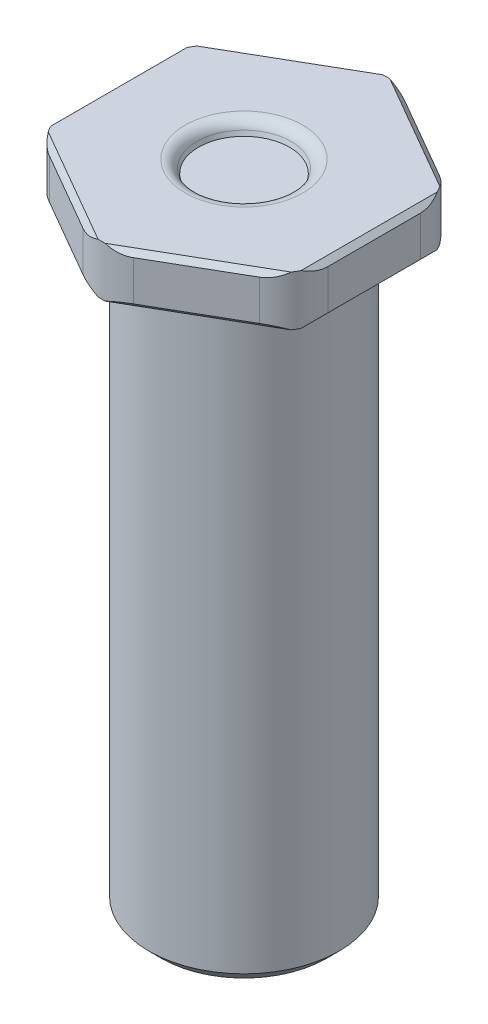
ISO-10303-21;
HEADER;
FILE_DESCRIPTION(('STEP AP214'),'2;1');
FILE_NAME('part.step','',(''),(''),'','','');
FILE_SCHEMA(('AUTOMOTIVE_DESIGN { 1 0 10303 214 1 1 1 1 }'));
ENDSEC;
DATA;
#1=APPLICATION_CONTEXT('core data for automotive mechanical design processes');
#2=APPLICATION_PROTOCOL_DEFINITION('international standard','automotive_design',2000,#1);
#3=PRODUCT_CONTEXT('',#1,'mechanical');
#4=PRODUCT('Part','Part','',(#3));
#5=PRODUCT_RELATED_PRODUCT_CATEGORY('part','',(#4));
#6=PRODUCT_DEFINITION_FORMATION('','',#4);
#7=PRODUCT_DEFINITION_CONTEXT('part definition',#1,'design');
#8=PRODUCT_DEFINITION('design','',#6,#7);
#9=PRODUCT_DEFINITION_SHAPE('','',#8);
#10=(LENGTH_UNIT() NAMED_UNIT(*) SI_UNIT(.MILLI.,.METRE.));
#11=(NAMED_UNIT(*) PLANE_ANGLE_UNIT() SI_UNIT($,.RADIAN.));
#12=(NAMED_UNIT(*) SI_UNIT($,.STERADIAN.) SOLID_ANGLE_UNIT());
#13=UNCERTAINTY_MEASURE_WITH_UNIT(LENGTH_MEASURE(1.E-05),#10,'distance_accuracy_value','');
#14=(GEOMETRIC_REPRESENTATION_CONTEXT(3) GLOBAL_UNCERTAINTY_ASSIGNED_CONTEXT((#13)) GLOBAL_UNIT_ASSIGNED_CONTEXT((#10,
#11,#12)) REPRESENTATION_CONTEXT('',''));
#15=CARTESIAN_POINT('',(0.,0.,0.));
#16=DIRECTION('',(0.,0.,1.));
#17=DIRECTION('',(1.,0.,0.));
#18=AXIS2_PLACEMENT_3D('',#15,#16,#17);
#19=CARTESIAN_POINT('',(0.,63.5,0.));
#20=DIRECTION('',(0.,-1.,0.));
#21=DIRECTION('',(0.,0.,-1.));
#22=AXIS2_PLACEMENT_3D('',#19,#20,#21);
#23=CYLINDRICAL_SURFACE('',#22,9.652);
#24=CARTESIAN_POINT('',(0.,1.27000000000002,0.));
#25=DIRECTION('',(0.,1.,0.));
#26=DIRECTION('',(0.,0.,1.));
#27=AXIS2_PLACEMENT_3D('',#24,#25,#26);
#28=CIRCLE('',#27,9.652);
#29=CARTESIAN_POINT('',(0.,1.27000000000002,9.652));
#30=VERTEX_POINT('',#29);
#31=EDGE_CURVE('E547',#30,#30,#28,.T.);
#32=ORIENTED_EDGE('',*,*,#31,.T.);
#33=EDGE_LOOP('',(#32));
#34=FACE_BOUND('',#33,.T.);
#35=CARTESIAN_POINT('',(0.,60.96,0.));
#36=DIRECTION('',(0.,1.,0.));
#37=DIRECTION('',(0.,0.,1.));
#38=AXIS2_PLACEMENT_3D('',#35,#36,#37);
#39=CIRCLE('',#38,9.652);
#40=CARTESIAN_POINT('',(0.,60.96,9.652));
#41=VERTEX_POINT('',#40);
#42=EDGE_CURVE('E539',#41,#41,#39,.T.);
#43=ORIENTED_EDGE('',*,*,#42,.F.);
#44=EDGE_LOOP('',(#43));
#45=FACE_BOUND('',#44,.T.);
#46=ADVANCED_FACE('F35',(#34,#45),#23,.T.);
#47=CARTESIAN_POINT('',(0.,0.,0.));
#48=DIRECTION('',(0.,1.,0.));
#49=DIRECTION('',(0.,0.,1.));
#50=AXIS2_PLACEMENT_3D('',#47,#48,#49);
#51=PLANE('',#50);
#52=CARTESIAN_POINT('',(0.,0.,0.));
#53=DIRECTION('',(0.,1.,0.));
#54=DIRECTION('',(0.,0.,1.));
#55=AXIS2_PLACEMENT_3D('',#52,#53,#54);
#56=CIRCLE('',#55,8.38199999999997);
#57=CARTESIAN_POINT('',(0.,0.,8.38199999999997));
#58=VERTEX_POINT('',#57);
#59=EDGE_CURVE('E542',#58,#58,#56,.F.);
#60=ORIENTED_EDGE('',*,*,#59,.T.);
#61=EDGE_LOOP('',(#60));
#62=FACE_BOUND('',#61,.T.);
#63=ADVANCED_FACE('F297',(#62),#51,.F.);
#64=CARTESIAN_POINT('',(0.,1.27000000000002,0.));
#65=DIRECTION('',(0.,1.,0.));
#66=DIRECTION('',(0.,0.,1.));
#67=AXIS2_PLACEMENT_3D('',#64,#65,#66);
#68=CONICAL_SURFACE('',#67,9.652,0.78539816339745);
#69=ORIENTED_EDGE('',*,*,#59,.F.);
#70=EDGE_LOOP('',(#69));
#71=FACE_BOUND('',#70,.T.);
#72=ORIENTED_EDGE('',*,*,#31,.F.);
#73=EDGE_LOOP('',(#72));
#74=FACE_BOUND('',#73,.T.);
#75=ADVANCED_FACE('F303',(#71,#74),#68,.T.);
#76=CARTESIAN_POINT('',(0.,60.96,0.));
#77=DIRECTION('',(0.,1.,0.));
#78=DIRECTION('',(0.,0.,1.));
#79=AXIS2_PLACEMENT_3D('',#76,#77,#78);
#80=PLANE('',#79);
#81=DIRECTION('',(0.,0.,-1.));
#82=VECTOR('',#81,1.);
#83=CARTESIAN_POINT('',(-12.6902271536748,60.96,0.));
#84=LINE('',#83,#82);
#85=CARTESIAN_POINT('',(-12.6902271536748,60.96,6.90138129583535));
#86=VERTEX_POINT('',#85);
#87=CARTESIAN_POINT('',(-12.6902271536748,60.96,-6.90138129583534));
#88=VERTEX_POINT('',#87);
#89=EDGE_CURVE('E438',#86,#88,#84,.T.);
#90=ORIENTED_EDGE('',*,*,#89,.T.);
#91=CARTESIAN_POINT('',(-8.11822715367484,60.96,-4.68706063251669));
#92=DIRECTION('',(0.,1.,0.));
#93=DIRECTION('',(0.,0.,1.));
#94=AXIS2_PLACEMENT_3D('',#91,#92,#93);
#95=CIRCLE('',#94,5.08);
#96=CARTESIAN_POINT('',(-12.3218851002336,60.96,-7.53936844695982));
#97=VERTEX_POINT('',#96);
#98=EDGE_CURVE('E467',#88,#97,#95,.F.);
#99=ORIENTED_EDGE('',*,*,#98,.T.);
#100=DIRECTION('',(0.866025403784439,0.,-0.5));
#101=VECTOR('',#100,1.);
#102=CARTESIAN_POINT('',(-6.34511357683742,60.96,-10.9900590948775));
#103=LINE('',#102,#101);
#104=CARTESIAN_POINT('',(-0.368342053441244,60.96,-14.4407497427952));
#105=VERTEX_POINT('',#104);
#106=EDGE_CURVE('E447',#97,#105,#103,.T.);
#107=ORIENTED_EDGE('',*,*,#106,.T.);
#108=CARTESIAN_POINT('',(0.,60.96,-9.37412126503338));
#109=DIRECTION('',(0.,1.,0.));
#110=DIRECTION('',(0.,0.,1.));
#111=AXIS2_PLACEMENT_3D('',#108,#109,#110);
#112=CIRCLE('',#111,5.08);
#113=CARTESIAN_POINT('',(0.368342053441237,60.96,-14.4407497427952));
#114=VERTEX_POINT('',#113);
#115=EDGE_CURVE('E463',#105,#114,#112,.F.);
#116=ORIENTED_EDGE('',*,*,#115,.T.);
#117=DIRECTION('',(0.866025403784439,0.,0.5));
#118=VECTOR('',#117,1.);
#119=CARTESIAN_POINT('',(6.34511357683741,60.96,-10.9900590948775));
#120=LINE('',#119,#118);
#121=CARTESIAN_POINT('',(12.3218851002336,60.96,-7.53936844695983));
#122=VERTEX_POINT('',#121);
#123=EDGE_CURVE('E211',#114,#122,#120,.T.);
#124=ORIENTED_EDGE('',*,*,#123,.T.);
#125=CARTESIAN_POINT('',(8.11822715367482,60.96,-4.6870606325167));
#126=DIRECTION('',(0.,1.,0.));
#127=DIRECTION('',(0.,0.,1.));
#128=AXIS2_PLACEMENT_3D('',#125,#126,#127);
#129=CIRCLE('',#128,5.08);
#130=CARTESIAN_POINT('',(12.6902271536748,60.96,-6.90138129583535));
#131=VERTEX_POINT('',#130);
#132=EDGE_CURVE('E461',#122,#131,#129,.F.);
#133=ORIENTED_EDGE('',*,*,#132,.T.);
#134=DIRECTION('',(0.,0.,1.));
#135=VECTOR('',#134,1.);
#136=CARTESIAN_POINT('',(12.6902271536748,60.96,0.));
#137=LINE('',#136,#135);
#138=CARTESIAN_POINT('',(12.6902271536748,60.96,6.90138129583534));
#139=VERTEX_POINT('',#138);
#140=EDGE_CURVE('E444',#131,#139,#137,.T.);
#141=ORIENTED_EDGE('',*,*,#140,.T.);
#142=CARTESIAN_POINT('',(8.11822715367482,60.96,4.6870606325167));
#143=DIRECTION('',(0.,1.,0.));
#144=DIRECTION('',(0.,0.,1.));
#145=AXIS2_PLACEMENT_3D('',#142,#143,#144);
#146=CIRCLE('',#145,5.08);
#147=CARTESIAN_POINT('',(12.3218851002336,60.96,7.53936844695984));
#148=VERTEX_POINT('',#147);
#149=EDGE_CURVE('E459',#139,#148,#146,.F.);
#150=ORIENTED_EDGE('',*,*,#149,.T.);
#151=DIRECTION('',(-0.866025403784439,0.,0.5));
#152=VECTOR('',#151,1.);
#153=CARTESIAN_POINT('',(6.34511357683742,60.96,10.9900590948775));
#154=LINE('',#153,#152);
#155=CARTESIAN_POINT('',(0.368342053441251,60.96,14.4407497427952));
#156=VERTEX_POINT('',#155);
#157=EDGE_CURVE('E441',#148,#156,#154,.T.);
#158=ORIENTED_EDGE('',*,*,#157,.T.);
#159=CARTESIAN_POINT('',(0.,60.96,9.37412126503338));
#160=DIRECTION('',(0.,1.,0.));
#161=DIRECTION('',(0.,0.,1.));
#162=AXIS2_PLACEMENT_3D('',#159,#160,#161);
#163=CIRCLE('',#162,5.08);
#164=CARTESIAN_POINT('',(-0.368342053441251,60.96,14.4407497427952));
#165=VERTEX_POINT('',#164);
#166=EDGE_CURVE('E457',#156,#165,#163,.F.);
#167=ORIENTED_EDGE('',*,*,#166,.T.);
#168=DIRECTION('',(-0.866025403784439,0.,-0.5));
#169=VECTOR('',#168,1.);
#170=CARTESIAN_POINT('',(-6.34511357683742,60.96,10.9900590948775));
#171=LINE('',#170,#169);
#172=CARTESIAN_POINT('',(-12.3218851002336,60.96,7.53936844695984));
#173=VERTEX_POINT('',#172);
#174=EDGE_CURVE('E435',#165,#173,#171,.T.);
#175=ORIENTED_EDGE('',*,*,#174,.T.);
#176=CARTESIAN_POINT('',(-8.11822715367483,60.96,4.68706063251669));
#177=DIRECTION('',(0.,1.,0.));
#178=DIRECTION('',(0.,0.,1.));
#179=AXIS2_PLACEMENT_3D('',#176,#177,#178);
#180=CIRCLE('',#179,5.08);
#181=EDGE_CURVE('E465',#173,#86,#180,.F.);
#182=ORIENTED_EDGE('',*,*,#181,.T.);
#183=EDGE_LOOP('',(#90,#99,#107,#116,#124,#133,#141,#150,#158,#167,#175,#182));
#184=FACE_BOUND('',#183,.T.);
#185=ORIENTED_EDGE('',*,*,#42,.T.);
#186=EDGE_LOOP('',(#185));
#187=FACE_BOUND('',#186,.T.);
#188=ADVANCED_FACE('F312',(#184,#187),#80,.F.);
#189=CARTESIAN_POINT('',(13.1982271536748,66.04,-7.62));
#190=DIRECTION('',(-0.5,0.,0.866025403784439));
#191=DIRECTION('',(0.866025403784439,0.,0.5));
#192=AXIS2_PLACEMENT_3D('',#189,#190,#191);
#193=PLANE('',#192);
#194=DIRECTION('',(-0.866025403784439,0.,-0.5));
#195=VECTOR('',#194,1.);
#196=CARTESIAN_POINT('',(13.1982271536748,61.468,-7.62));
#197=LINE('',#196,#195);
#198=CARTESIAN_POINT('',(10.6582271536748,61.468,-9.08646968374165));
#199=VERTEX_POINT('',#198);
#200=CARTESIAN_POINT('',(2.54,61.468,-13.7735303162583));
#201=VERTEX_POINT('',#200);
#202=EDGE_CURVE('E429',#199,#201,#197,.T.);
#203=ORIENTED_EDGE('',*,*,#202,.T.);
#204=DIRECTION('',(0.,-1.,0.));
#205=VECTOR('',#204,1.);
#206=CARTESIAN_POINT('',(2.54,66.04,-13.7735303162583));
#207=LINE('',#206,#205);
#208=CARTESIAN_POINT('',(2.54,65.532,-13.7735303162583));
#209=VERTEX_POINT('',#208);
#210=EDGE_CURVE('E252',#201,#209,#207,.F.);
#211=ORIENTED_EDGE('',*,*,#210,.T.);
#212=DIRECTION('',(0.866025403784439,0.,0.5));
#213=VECTOR('',#212,1.);
#214=CARTESIAN_POINT('',(13.1982271536748,65.532,-7.62));
#215=LINE('',#214,#213);
#216=CARTESIAN_POINT('',(10.6582271536748,65.532,-9.08646968374165));
#217=VERTEX_POINT('',#216);
#218=EDGE_CURVE('E432',#209,#217,#215,.T.);
#219=ORIENTED_EDGE('',*,*,#218,.T.);
#220=DIRECTION('',(0.,-1.,0.));
#221=VECTOR('',#220,1.);
#222=CARTESIAN_POINT('',(10.6582271536748,66.04,-9.08646968374165));
#223=LINE('',#222,#221);
#224=EDGE_CURVE('E249',#217,#199,#223,.T.);
#225=ORIENTED_EDGE('',*,*,#224,.T.);
#226=EDGE_LOOP('',(#203,#211,#219,#225));
#227=FACE_BOUND('',#226,.T.);
#228=ADVANCED_FACE('F557',(#227),#193,.F.);
#229=CARTESIAN_POINT('',(0.,66.04,-15.24));
#230=DIRECTION('',(0.5,0.,0.866025403784439));
#231=DIRECTION('',(0.866025403784439,0.,-0.5));
#232=AXIS2_PLACEMENT_3D('',#229,#230,#231);
#233=PLANE('',#232);
#234=DIRECTION('',(-0.866025403784439,0.,0.5));
#235=VECTOR('',#234,1.);
#236=CARTESIAN_POINT('',(0.,61.468,-15.24));
#237=LINE('',#236,#235);
#238=CARTESIAN_POINT('',(-2.54,61.468,-13.7735303162583));
#239=VERTEX_POINT('',#238);
#240=CARTESIAN_POINT('',(-10.6582271536748,61.468,-9.08646968374164));
#241=VERTEX_POINT('',#240);
#242=EDGE_CURVE('E220',#239,#241,#237,.T.);
#243=ORIENTED_EDGE('',*,*,#242,.T.);
#244=DIRECTION('',(0.,-1.,0.));
#245=VECTOR('',#244,1.);
#246=CARTESIAN_POINT('',(-10.6582271536748,66.04,-9.08646968374164));
#247=LINE('',#246,#245);
#248=CARTESIAN_POINT('',(-10.6582271536748,65.532,-9.08646968374164));
#249=VERTEX_POINT('',#248);
#250=EDGE_CURVE('E476',#241,#249,#247,.F.);
#251=ORIENTED_EDGE('',*,*,#250,.T.);
#252=DIRECTION('',(0.866025403784439,0.,-0.5));
#253=VECTOR('',#252,1.);
#254=CARTESIAN_POINT('',(0.,65.532,-15.24));
#255=LINE('',#254,#253);
#256=CARTESIAN_POINT('',(-2.54,65.532,-13.7735303162583));
#257=VERTEX_POINT('',#256);
#258=EDGE_CURVE('E426',#249,#257,#255,.T.);
#259=ORIENTED_EDGE('',*,*,#258,.T.);
#260=DIRECTION('',(0.,-1.,0.));
#261=VECTOR('',#260,1.);
#262=CARTESIAN_POINT('',(-2.54,66.04,-13.7735303162583));
#263=LINE('',#262,#261);
#264=EDGE_CURVE('E473',#257,#239,#263,.T.);
#265=ORIENTED_EDGE('',*,*,#264,.T.);
#266=EDGE_LOOP('',(#243,#251,#259,#265));
#267=FACE_BOUND('',#266,.T.);
#268=ADVANCED_FACE('F502',(#267),#233,.F.);
#269=CARTESIAN_POINT('',(-13.1982271536748,66.04,-7.61999999999999));
#270=DIRECTION('',(1.,0.,0.));
#271=DIRECTION('',(0.,0.,-1.));
#272=AXIS2_PLACEMENT_3D('',#269,#270,#271);
#273=PLANE('',#272);
#274=DIRECTION('',(0.,0.,-1.));
#275=VECTOR('',#274,1.);
#276=CARTESIAN_POINT('',(-13.1982271536748,65.532,-7.61999999999999));
#277=LINE('',#276,#275);
#278=CARTESIAN_POINT('',(-13.1982271536748,65.532,4.68706063251669));
#279=VERTEX_POINT('',#278);
#280=CARTESIAN_POINT('',(-13.1982271536748,65.532,-4.68706063251669));
#281=VERTEX_POINT('',#280);
#282=EDGE_CURVE('E203',#279,#281,#277,.T.);
#283=ORIENTED_EDGE('',*,*,#282,.T.);
#284=DIRECTION('',(0.,-1.,0.));
#285=VECTOR('',#284,1.);
#286=CARTESIAN_POINT('',(-13.1982271536748,66.04,-4.68706063251669));
#287=LINE('',#286,#285);
#288=CARTESIAN_POINT('',(-13.1982271536748,61.468,-4.68706063251669));
#289=VERTEX_POINT('',#288);
#290=EDGE_CURVE('E210',#281,#289,#287,.T.);
#291=ORIENTED_EDGE('',*,*,#290,.T.);
#292=DIRECTION('',(0.,0.,1.));
#293=VECTOR('',#292,1.);
#294=CARTESIAN_POINT('',(-13.1982271536748,61.468,-7.61999999999999));
#295=LINE('',#294,#293);
#296=CARTESIAN_POINT('',(-13.1982271536748,61.468,4.68706063251669));
#297=VERTEX_POINT('',#296);
#298=EDGE_CURVE('E206',#289,#297,#295,.T.);
#299=ORIENTED_EDGE('',*,*,#298,.T.);
#300=DIRECTION('',(0.,-1.,0.));
#301=VECTOR('',#300,1.);
#302=CARTESIAN_POINT('',(-13.1982271536748,66.04,4.68706063251669));
#303=LINE('',#302,#301);
#304=EDGE_CURVE('E199',#297,#279,#303,.F.);
#305=ORIENTED_EDGE('',*,*,#304,.T.);
#306=EDGE_LOOP('',(#283,#291,#299,#305));
#307=FACE_BOUND('',#306,.T.);
#308=ADVANCED_FACE('F201',(#307),#273,.F.);
#309=CARTESIAN_POINT('',(-13.1982271536748,66.04,7.62));
#310=DIRECTION('',(0.5,0.,-0.866025403784439));
#311=DIRECTION('',(-0.866025403784439,0.,-0.5));
#312=AXIS2_PLACEMENT_3D('',#309,#310,#311);
#313=PLANE('',#312);
#314=DIRECTION('',(-0.866025403784439,0.,-0.5));
#315=VECTOR('',#314,1.);
#316=CARTESIAN_POINT('',(-13.1982271536748,65.532,7.62));
#317=LINE('',#316,#315);
#318=CARTESIAN_POINT('',(-2.54,65.532,13.7735303162583));
#319=VERTEX_POINT('',#318);
#320=CARTESIAN_POINT('',(-10.6582271536748,65.532,9.08646968374164));
#321=VERTEX_POINT('',#320);
#322=EDGE_CURVE('E394',#319,#321,#317,.T.);
#323=ORIENTED_EDGE('',*,*,#322,.T.);
#324=DIRECTION('',(0.,-1.,0.));
#325=VECTOR('',#324,1.);
#326=CARTESIAN_POINT('',(-10.6582271536748,66.04,9.08646968374164));
#327=LINE('',#326,#325);
#328=CARTESIAN_POINT('',(-10.6582271536748,61.468,9.08646968374164));
#329=VERTEX_POINT('',#328);
#330=EDGE_CURVE('E234',#321,#329,#327,.T.);
#331=ORIENTED_EDGE('',*,*,#330,.T.);
#332=DIRECTION('',(0.866025403784439,0.,0.5));
#333=VECTOR('',#332,1.);
#334=CARTESIAN_POINT('',(-13.1982271536748,61.468,7.62));
#335=LINE('',#334,#333);
#336=CARTESIAN_POINT('',(-2.54,61.468,13.7735303162583));
#337=VERTEX_POINT('',#336);
#338=EDGE_CURVE('E419',#329,#337,#335,.T.);
#339=ORIENTED_EDGE('',*,*,#338,.T.);
#340=DIRECTION('',(0.,-1.,0.));
#341=VECTOR('',#340,1.);
#342=CARTESIAN_POINT('',(-2.54,66.04,13.7735303162583));
#343=LINE('',#342,#341);
#344=EDGE_CURVE('E228',#337,#319,#343,.F.);
#345=ORIENTED_EDGE('',*,*,#344,.T.);
#346=EDGE_LOOP('',(#323,#331,#339,#345));
#347=FACE_BOUND('',#346,.T.);
#348=ADVANCED_FACE('F569',(#347),#313,.F.);
#349=CARTESIAN_POINT('',(0.,66.04,15.24));
#350=DIRECTION('',(-0.5,0.,-0.866025403784439));
#351=DIRECTION('',(-0.866025403784439,0.,0.5));
#352=AXIS2_PLACEMENT_3D('',#349,#350,#351);
#353=PLANE('',#352);
#354=DIRECTION('',(0.866025403784439,0.,-0.5));
#355=VECTOR('',#354,1.);
#356=CARTESIAN_POINT('',(0.,61.468,15.24));
#357=LINE('',#356,#355);
#358=CARTESIAN_POINT('',(2.54,61.468,13.7735303162583));
#359=VERTEX_POINT('',#358);
#360=CARTESIAN_POINT('',(10.6582271536748,61.468,9.08646968374165));
#361=VERTEX_POINT('',#360);
#362=EDGE_CURVE('E415',#359,#361,#357,.T.);
#363=ORIENTED_EDGE('',*,*,#362,.T.);
#364=DIRECTION('',(0.,-1.,0.));
#365=VECTOR('',#364,1.);
#366=CARTESIAN_POINT('',(10.6582271536748,66.04,9.08646968374165));
#367=LINE('',#366,#365);
#368=CARTESIAN_POINT('',(10.6582271536748,65.532,9.08646968374165));
#369=VERTEX_POINT('',#368);
#370=EDGE_CURVE('E57',#361,#369,#367,.F.);
#371=ORIENTED_EDGE('',*,*,#370,.T.);
#372=DIRECTION('',(-0.866025403784439,0.,0.5));
#373=VECTOR('',#372,1.);
#374=CARTESIAN_POINT('',(0.,65.532,15.24));
#375=LINE('',#374,#373);
#376=CARTESIAN_POINT('',(2.54,65.532,13.7735303162583));
#377=VERTEX_POINT('',#376);
#378=EDGE_CURVE('E417',#369,#377,#375,.T.);
#379=ORIENTED_EDGE('',*,*,#378,.T.);
#380=DIRECTION('',(0.,-1.,0.));
#381=VECTOR('',#380,1.);
#382=CARTESIAN_POINT('',(2.54,66.04,13.7735303162583));
#383=LINE('',#382,#381);
#384=EDGE_CURVE('E275',#377,#359,#383,.T.);
#385=ORIENTED_EDGE('',*,*,#384,.T.);
#386=EDGE_LOOP('',(#363,#371,#379,#385));
#387=FACE_BOUND('',#386,.T.);
#388=ADVANCED_FACE('F518',(#387),#353,.F.);
#389=CARTESIAN_POINT('',(13.1982271536748,66.04,7.62));
#390=DIRECTION('',(-1.,0.,0.));
#391=DIRECTION('',(0.,0.,1.));
#392=AXIS2_PLACEMENT_3D('',#389,#390,#391);
#393=PLANE('',#392);
#394=DIRECTION('',(0.,0.,-1.));
#395=VECTOR('',#394,1.);
#396=CARTESIAN_POINT('',(13.1982271536748,61.468,7.62));
#397=LINE('',#396,#395);
#398=CARTESIAN_POINT('',(13.1982271536748,61.468,4.68706063251669));
#399=VERTEX_POINT('',#398);
#400=CARTESIAN_POINT('',(13.1982271536748,61.468,-4.6870606325167));
#401=VERTEX_POINT('',#400);
#402=EDGE_CURVE('E409',#399,#401,#397,.T.);
#403=ORIENTED_EDGE('',*,*,#402,.T.);
#404=DIRECTION('',(0.,-1.,0.));
#405=VECTOR('',#404,1.);
#406=CARTESIAN_POINT('',(13.1982271536748,66.04,-4.6870606325167));
#407=LINE('',#406,#405);
#408=CARTESIAN_POINT('',(13.1982271536748,65.532,-4.6870606325167));
#409=VERTEX_POINT('',#408);
#410=EDGE_CURVE('E265',#401,#409,#407,.F.);
#411=ORIENTED_EDGE('',*,*,#410,.T.);
#412=DIRECTION('',(0.,0.,1.));
#413=VECTOR('',#412,1.);
#414=CARTESIAN_POINT('',(13.1982271536748,65.532,7.62));
#415=LINE('',#414,#413);
#416=CARTESIAN_POINT('',(13.1982271536748,65.532,4.68706063251669));
#417=VERTEX_POINT('',#416);
#418=EDGE_CURVE('E412',#409,#417,#415,.T.);
#419=ORIENTED_EDGE('',*,*,#418,.T.);
#420=DIRECTION('',(0.,-1.,0.));
#421=VECTOR('',#420,1.);
#422=CARTESIAN_POINT('',(13.1982271536748,66.04,4.68706063251669));
#423=LINE('',#422,#421);
#424=EDGE_CURVE('E262',#417,#399,#423,.T.);
#425=ORIENTED_EDGE('',*,*,#424,.T.);
#426=EDGE_LOOP('',(#403,#411,#419,#425));
#427=FACE_BOUND('',#426,.T.);
#428=ADVANCED_FACE('F531',(#427),#393,.F.);
#429=CARTESIAN_POINT('',(0.,66.04,0.));
#430=DIRECTION('',(0.,1.,0.));
#431=DIRECTION('',(0.,0.,1.));
#432=AXIS2_PLACEMENT_3D('',#429,#430,#431);
#433=PLANE('',#432);
#434=CARTESIAN_POINT('',(0.,66.04,0.));
#435=DIRECTION('',(0.,1.,0.));
#436=DIRECTION('',(0.,0.,1.));
#437=AXIS2_PLACEMENT_3D('',#434,#435,#436);
#438=CIRCLE('',#437,5.96926357352633);
#439=CARTESIAN_POINT('',(0.,66.04,5.96926357352633));
#440=VERTEX_POINT('',#439);
#441=EDGE_CURVE('E11',#440,#440,#438,.F.);
#442=ORIENTED_EDGE('',*,*,#441,.T.);
#443=EDGE_LOOP('',(#442));
#444=FACE_BOUND('',#443,.T.);
#445=DIRECTION('',(-0.866025403784439,0.,0.5));
#446=VECTOR('',#445,1.);
#447=CARTESIAN_POINT('',(-12.9442271536748,66.04,-7.1800590948775));
#448=LINE('',#447,#446);
#449=CARTESIAN_POINT('',(-0.36834205344124,66.04,-14.4407497427952));
#450=VERTEX_POINT('',#449);
#451=CARTESIAN_POINT('',(-12.3218851002336,66.04,-7.53936844695982));
#452=VERTEX_POINT('',#451);
#453=EDGE_CURVE('E403',#450,#452,#448,.T.);
#454=ORIENTED_EDGE('',*,*,#453,.T.);
#455=CARTESIAN_POINT('',(-8.11822715367484,66.04,-4.68706063251669));
#456=DIRECTION('',(0.,1.,0.));
#457=DIRECTION('',(0.,0.,1.));
#458=AXIS2_PLACEMENT_3D('',#455,#456,#457);
#459=CIRCLE('',#458,5.08);
#460=CARTESIAN_POINT('',(-12.6902271536748,66.04,-6.90138129583534));
#461=VERTEX_POINT('',#460);
#462=EDGE_CURVE('E226',#452,#461,#459,.T.);
#463=ORIENTED_EDGE('',*,*,#462,.T.);
#464=DIRECTION('',(0.,0.,1.));
#465=VECTOR('',#464,1.);
#466=CARTESIAN_POINT('',(-12.6902271536748,66.04,7.62));
#467=LINE('',#466,#465);
#468=CARTESIAN_POINT('',(-12.6902271536748,66.04,6.90138129583535));
#469=VERTEX_POINT('',#468);
#470=EDGE_CURVE('E399',#461,#469,#467,.T.);
#471=ORIENTED_EDGE('',*,*,#470,.T.);
#472=CARTESIAN_POINT('',(-8.11822715367483,66.04,4.68706063251669));
#473=DIRECTION('',(0.,1.,0.));
#474=DIRECTION('',(0.,0.,1.));
#475=AXIS2_PLACEMENT_3D('',#472,#473,#474);
#476=CIRCLE('',#475,5.08);
#477=CARTESIAN_POINT('',(-12.3218851002336,66.04,7.53936844695983));
#478=VERTEX_POINT('',#477);
#479=EDGE_CURVE('E225',#469,#478,#476,.T.);
#480=ORIENTED_EDGE('',*,*,#479,.T.);
#481=DIRECTION('',(0.866025403784439,0.,0.5));
#482=VECTOR('',#481,1.);
#483=CARTESIAN_POINT('',(0.253999999999995,66.04,14.8000590948775));
#484=LINE('',#483,#482);
#485=CARTESIAN_POINT('',(-0.368342053441251,66.04,14.4407497427952));
#486=VERTEX_POINT('',#485);
#487=EDGE_CURVE('E392',#478,#486,#484,.T.);
#488=ORIENTED_EDGE('',*,*,#487,.T.);
#489=CARTESIAN_POINT('',(0.,66.04,9.37412126503338));
#490=DIRECTION('',(0.,1.,0.));
#491=DIRECTION('',(0.,0.,1.));
#492=AXIS2_PLACEMENT_3D('',#489,#490,#491);
#493=CIRCLE('',#492,5.08);
#494=CARTESIAN_POINT('',(0.368342053441252,66.04,14.4407497427952));
#495=VERTEX_POINT('',#494);
#496=EDGE_CURVE('E388',#486,#495,#493,.T.);
#497=ORIENTED_EDGE('',*,*,#496,.T.);
#498=DIRECTION('',(0.866025403784439,0.,-0.5));
#499=VECTOR('',#498,1.);
#500=CARTESIAN_POINT('',(12.9442271536748,66.04,7.18005909487751));
#501=LINE('',#500,#499);
#502=CARTESIAN_POINT('',(12.3218851002336,66.04,7.53936844695984));
#503=VERTEX_POINT('',#502);
#504=EDGE_CURVE('E398',#495,#503,#501,.T.);
#505=ORIENTED_EDGE('',*,*,#504,.T.);
#506=CARTESIAN_POINT('',(8.11822715367482,66.04,4.6870606325167));
#507=DIRECTION('',(0.,1.,0.));
#508=DIRECTION('',(0.,0.,1.));
#509=AXIS2_PLACEMENT_3D('',#506,#507,#508);
#510=CIRCLE('',#509,5.08);
#511=CARTESIAN_POINT('',(12.6902271536748,66.04,6.90138129583534));
#512=VERTEX_POINT('',#511);
#513=EDGE_CURVE('E483',#503,#512,#510,.T.);
#514=ORIENTED_EDGE('',*,*,#513,.T.);
#515=DIRECTION('',(0.,0.,-1.));
#516=VECTOR('',#515,1.);
#517=CARTESIAN_POINT('',(12.6902271536748,66.04,-7.62));
#518=LINE('',#517,#516);
#519=CARTESIAN_POINT('',(12.6902271536748,66.04,-6.90138129583535));
#520=VERTEX_POINT('',#519);
#521=EDGE_CURVE('E401',#512,#520,#518,.T.);
#522=ORIENTED_EDGE('',*,*,#521,.T.);
#523=CARTESIAN_POINT('',(8.11822715367482,66.04,-4.6870606325167));
#524=DIRECTION('',(0.,1.,0.));
#525=DIRECTION('',(0.,0.,1.));
#526=AXIS2_PLACEMENT_3D('',#523,#524,#525);
#527=CIRCLE('',#526,5.08);
#528=CARTESIAN_POINT('',(12.3218851002336,66.04,-7.53936844695984));
#529=VERTEX_POINT('',#528);
#530=EDGE_CURVE('E485',#520,#529,#527,.T.);
#531=ORIENTED_EDGE('',*,*,#530,.T.);
#532=DIRECTION('',(-0.866025403784439,0.,-0.5));
#533=VECTOR('',#532,1.);
#534=CARTESIAN_POINT('',(-0.253999999999997,66.04,-14.8000590948775));
#535=LINE('',#534,#533);
#536=CARTESIAN_POINT('',(0.36834205344124,66.04,-14.4407497427952));
#537=VERTEX_POINT('',#536);
#538=EDGE_CURVE('E493',#529,#537,#535,.T.);
#539=ORIENTED_EDGE('',*,*,#538,.T.);
#540=CARTESIAN_POINT('',(0.,66.04,-9.37412126503338));
#541=DIRECTION('',(0.,1.,0.));
#542=DIRECTION('',(0.,0.,1.));
#543=AXIS2_PLACEMENT_3D('',#540,#541,#542);
#544=CIRCLE('',#543,5.08);
#545=EDGE_CURVE('E487',#537,#450,#544,.T.);
#546=ORIENTED_EDGE('',*,*,#545,.T.);
#547=EDGE_LOOP('',(#454,#463,#471,#480,#488,#497,#505,#514,#522,#531,#539,#546));
#548=FACE_BOUND('',#547,.T.);
#549=ADVANCED_FACE('F336',(#444,#548),#433,.T.);
#550=CARTESIAN_POINT('',(-12.6902271536748,66.04,0.));
#551=DIRECTION('',(-0.707106781186548,0.707106781186548,0.));
#552=DIRECTION('',(0.,0.,-1.));
#553=AXIS2_PLACEMENT_3D('',#550,#551,#552);
#554=PLANE('',#553);
#555=ORIENTED_EDGE('',*,*,#470,.F.);
#556=CARTESIAN_POINT('',(-8.11822715367484,70.612,-4.68706063251669));
#557=DIRECTION('',(-0.707106781186548,0.707106781186548,0.));
#558=DIRECTION('',(-0.707106781186548,-0.707106781186548,0.));
#559=AXIS2_PLACEMENT_3D('',#556,#557,#558);
#560=ELLIPSE('',#559,7.18420489685532,5.08);
#561=EDGE_CURVE('E219',#461,#281,#560,.T.);
#562=ORIENTED_EDGE('',*,*,#561,.T.);
#563=ORIENTED_EDGE('',*,*,#282,.F.);
#564=CARTESIAN_POINT('',(-8.11822715367483,70.612,4.68706063251669));
#565=DIRECTION('',(-0.707106781186548,0.707106781186548,0.));
#566=DIRECTION('',(-0.707106781186548,-0.707106781186548,0.));
#567=AXIS2_PLACEMENT_3D('',#564,#565,#566);
#568=ELLIPSE('',#567,7.18420489685532,5.08);
#569=EDGE_CURVE('E216',#279,#469,#568,.T.);
#570=ORIENTED_EDGE('',*,*,#569,.T.);
#571=EDGE_LOOP('',(#555,#562,#563,#570));
#572=FACE_BOUND('',#571,.T.);
#573=ADVANCED_FACE('F215',(#572),#554,.T.);
#574=CARTESIAN_POINT('',(-6.34511357683742,66.04,10.9900590948775));
#575=DIRECTION('',(-0.353553390593274,0.707106781186547,0.612372435695795));
#576=DIRECTION('',(-0.866025403784439,0.,-0.5));
#577=AXIS2_PLACEMENT_3D('',#574,#575,#576);
#578=PLANE('',#577);
#579=ORIENTED_EDGE('',*,*,#487,.F.);
#580=CARTESIAN_POINT('',(-8.11822715367483,70.612,4.68706063251669));
#581=DIRECTION('',(-0.353553390593274,0.707106781186547,0.612372435695795));
#582=DIRECTION('',(-0.353553390593273,-0.707106781186549,0.612372435695794));
#583=AXIS2_PLACEMENT_3D('',#580,#581,#582);
#584=ELLIPSE('',#583,7.18420489685533,5.08);
#585=EDGE_CURVE('E243',#478,#321,#584,.T.);
#586=ORIENTED_EDGE('',*,*,#585,.T.);
#587=ORIENTED_EDGE('',*,*,#322,.F.);
#588=CARTESIAN_POINT('',(0.,70.612,9.37412126503338));
#589=DIRECTION('',(-0.353553390593274,0.707106781186547,0.612372435695795));
#590=DIRECTION('',(-0.353553390593273,-0.707106781186549,0.612372435695794));
#591=AXIS2_PLACEMENT_3D('',#588,#589,#590);
#592=ELLIPSE('',#591,7.18420489685533,5.08);
#593=EDGE_CURVE('E241',#319,#486,#592,.T.);
#594=ORIENTED_EDGE('',*,*,#593,.T.);
#595=EDGE_LOOP('',(#579,#586,#587,#594));
#596=FACE_BOUND('',#595,.T.);
#597=ADVANCED_FACE('F329',(#596),#578,.T.);
#598=CARTESIAN_POINT('',(-6.34511357683742,66.04,-10.9900590948775));
#599=DIRECTION('',(-0.353553390593274,0.707106781186547,-0.612372435695795));
#600=DIRECTION('',(0.866025403784439,0.,-0.5));
#601=AXIS2_PLACEMENT_3D('',#598,#599,#600);
#602=PLANE('',#601);
#603=ORIENTED_EDGE('',*,*,#258,.F.);
#604=CARTESIAN_POINT('',(-8.11822715367484,70.612,-4.68706063251669));
#605=DIRECTION('',(-0.353553390593274,0.707106781186547,-0.612372435695795));
#606=DIRECTION('',(-0.353553390593274,-0.707106781186548,-0.612372435695794));
#607=AXIS2_PLACEMENT_3D('',#604,#605,#606);
#608=ELLIPSE('',#607,7.18420489685533,5.08);
#609=EDGE_CURVE('E480',#249,#452,#608,.T.);
#610=ORIENTED_EDGE('',*,*,#609,.T.);
#611=ORIENTED_EDGE('',*,*,#453,.F.);
#612=CARTESIAN_POINT('',(0.,70.612,-9.37412126503338));
#613=DIRECTION('',(-0.353553390593274,0.707106781186547,-0.612372435695795));
#614=DIRECTION('',(-0.353553390593274,-0.707106781186548,-0.612372435695794));
#615=AXIS2_PLACEMENT_3D('',#612,#613,#614);
#616=ELLIPSE('',#615,7.18420489685533,5.08);
#617=EDGE_CURVE('E478',#450,#257,#616,.T.);
#618=ORIENTED_EDGE('',*,*,#617,.T.);
#619=EDGE_LOOP('',(#603,#610,#611,#618));
#620=FACE_BOUND('',#619,.T.);
#621=ADVANCED_FACE('F326',(#620),#602,.T.);
#622=CARTESIAN_POINT('',(6.34511357683742,66.04,10.9900590948775));
#623=DIRECTION('',(0.353553390593274,0.707106781186547,0.612372435695795));
#624=DIRECTION('',(-0.866025403784439,0.,0.5));
#625=AXIS2_PLACEMENT_3D('',#622,#623,#624);
#626=PLANE('',#625);
#627=ORIENTED_EDGE('',*,*,#378,.F.);
#628=CARTESIAN_POINT('',(8.11822715367482,70.612,4.6870606325167));
#629=DIRECTION('',(0.353553390593274,0.707106781186547,0.612372435695795));
#630=DIRECTION('',(0.353553390593273,-0.707106781186548,0.612372435695794));
#631=AXIS2_PLACEMENT_3D('',#628,#629,#630);
#632=ELLIPSE('',#631,7.18420489685533,5.08);
#633=EDGE_CURVE('E280',#369,#503,#632,.T.);
#634=ORIENTED_EDGE('',*,*,#633,.T.);
#635=ORIENTED_EDGE('',*,*,#504,.F.);
#636=CARTESIAN_POINT('',(0.,70.612,9.37412126503338));
#637=DIRECTION('',(0.353553390593274,0.707106781186547,0.612372435695795));
#638=DIRECTION('',(0.353553390593273,-0.707106781186548,0.612372435695794));
#639=AXIS2_PLACEMENT_3D('',#636,#637,#638);
#640=ELLIPSE('',#639,7.18420489685533,5.08);
#641=EDGE_CURVE('E50',#495,#377,#640,.T.);
#642=ORIENTED_EDGE('',*,*,#641,.T.);
#643=EDGE_LOOP('',(#627,#634,#635,#642));
#644=FACE_BOUND('',#643,.T.);
#645=ADVANCED_FACE('F322',(#644),#626,.T.);
#646=CARTESIAN_POINT('',(6.34511357683742,66.04,-10.9900590948775));
#647=DIRECTION('',(0.353553390593274,0.707106781186547,-0.612372435695795));
#648=DIRECTION('',(0.866025403784439,0.,0.5));
#649=AXIS2_PLACEMENT_3D('',#646,#647,#648);
#650=PLANE('',#649);
#651=ORIENTED_EDGE('',*,*,#218,.F.);
#652=CARTESIAN_POINT('',(0.,70.612,-9.37412126503338));
#653=DIRECTION('',(0.353553390593274,0.707106781186547,-0.612372435695795));
#654=DIRECTION('',(0.353553390593273,-0.707106781186548,-0.612372435695794));
#655=AXIS2_PLACEMENT_3D('',#652,#653,#654);
#656=ELLIPSE('',#655,7.18420489685533,5.08);
#657=EDGE_CURVE('E256',#209,#537,#656,.T.);
#658=ORIENTED_EDGE('',*,*,#657,.T.);
#659=ORIENTED_EDGE('',*,*,#538,.F.);
#660=CARTESIAN_POINT('',(8.11822715367482,70.612,-4.6870606325167));
#661=DIRECTION('',(0.353553390593274,0.707106781186547,-0.612372435695795));
#662=DIRECTION('',(0.353553390593273,-0.707106781186548,-0.612372435695794));
#663=AXIS2_PLACEMENT_3D('',#660,#661,#662);
#664=ELLIPSE('',#663,7.18420489685533,5.08);
#665=EDGE_CURVE('E254',#529,#217,#664,.T.);
#666=ORIENTED_EDGE('',*,*,#665,.T.);
#667=EDGE_LOOP('',(#651,#658,#659,#666));
#668=FACE_BOUND('',#667,.T.);
#669=ADVANCED_FACE('F318',(#668),#650,.T.);
#670=CARTESIAN_POINT('',(12.6902271536748,66.04,0.));
#671=DIRECTION('',(0.707106781186548,0.707106781186547,0.));
#672=DIRECTION('',(0.,0.,1.));
#673=AXIS2_PLACEMENT_3D('',#670,#671,#672);
#674=PLANE('',#673);
#675=ORIENTED_EDGE('',*,*,#418,.F.);
#676=CARTESIAN_POINT('',(8.11822715367482,70.612,-4.6870606325167));
#677=DIRECTION('',(0.707106781186548,0.707106781186547,0.));
#678=DIRECTION('',(0.707106781186547,-0.707106781186548,0.));
#679=AXIS2_PLACEMENT_3D('',#676,#677,#678);
#680=ELLIPSE('',#679,7.18420489685533,5.08);
#681=EDGE_CURVE('E269',#409,#520,#680,.T.);
#682=ORIENTED_EDGE('',*,*,#681,.T.);
#683=ORIENTED_EDGE('',*,*,#521,.F.);
#684=CARTESIAN_POINT('',(8.11822715367482,70.612,4.6870606325167));
#685=DIRECTION('',(0.707106781186548,0.707106781186547,0.));
#686=DIRECTION('',(0.707106781186547,-0.707106781186548,0.));
#687=AXIS2_PLACEMENT_3D('',#684,#685,#686);
#688=ELLIPSE('',#687,7.18420489685533,5.08);
#689=EDGE_CURVE('E267',#512,#417,#688,.T.);
#690=ORIENTED_EDGE('',*,*,#689,.T.);
#691=EDGE_LOOP('',(#675,#682,#683,#690));
#692=FACE_BOUND('',#691,.T.);
#693=ADVANCED_FACE('F314',(#692),#674,.T.);
#694=CARTESIAN_POINT('',(-13.1982271536748,61.468,7.62));
#695=DIRECTION('',(0.353553390593274,0.707106781186547,-0.612372435695795));
#696=DIRECTION('',(0.866025403784439,0.,0.5));
#697=AXIS2_PLACEMENT_3D('',#694,#695,#696);
#698=PLANE('',#697);
#699=ORIENTED_EDGE('',*,*,#338,.F.);
#700=CARTESIAN_POINT('',(-8.11822715367483,56.388,4.68706063251669));
#701=DIRECTION('',(0.353553390593274,0.707106781186547,-0.612372435695795));
#702=DIRECTION('',(0.353553390593273,-0.707106781186549,-0.612372435695794));
#703=AXIS2_PLACEMENT_3D('',#700,#701,#702);
#704=ELLIPSE('',#703,7.18420489685533,5.08);
#705=EDGE_CURVE('E239',#329,#173,#704,.F.);
#706=ORIENTED_EDGE('',*,*,#705,.T.);
#707=ORIENTED_EDGE('',*,*,#174,.F.);
#708=CARTESIAN_POINT('',(0.,56.388,9.37412126503338));
#709=DIRECTION('',(0.353553390593274,0.707106781186547,-0.612372435695795));
#710=DIRECTION('',(0.353553390593273,-0.707106781186549,-0.612372435695794));
#711=AXIS2_PLACEMENT_3D('',#708,#709,#710);
#712=ELLIPSE('',#711,7.18420489685533,5.08);
#713=EDGE_CURVE('E237',#165,#337,#712,.F.);
#714=ORIENTED_EDGE('',*,*,#713,.T.);
#715=EDGE_LOOP('',(#699,#706,#707,#714));
#716=FACE_BOUND('',#715,.T.);
#717=ADVANCED_FACE('F317',(#716),#698,.F.);
#718=CARTESIAN_POINT('',(0.,61.468,15.24));
#719=DIRECTION('',(-0.353553390593274,0.707106781186547,-0.612372435695795));
#720=DIRECTION('',(0.866025403784439,0.,-0.5));
#721=AXIS2_PLACEMENT_3D('',#718,#719,#720);
#722=PLANE('',#721);
#723=ORIENTED_EDGE('',*,*,#157,.F.);
#724=CARTESIAN_POINT('',(8.11822715367482,56.388,4.6870606325167));
#725=DIRECTION('',(-0.353553390593274,0.707106781186547,-0.612372435695795));
#726=DIRECTION('',(-0.353553390593273,-0.707106781186548,-0.612372435695794));
#727=AXIS2_PLACEMENT_3D('',#724,#725,#726);
#728=ELLIPSE('',#727,7.18420489685533,5.08);
#729=EDGE_CURVE('E273',#148,#361,#728,.F.);
#730=ORIENTED_EDGE('',*,*,#729,.T.);
#731=ORIENTED_EDGE('',*,*,#362,.F.);
#732=CARTESIAN_POINT('',(0.,56.388,9.37412126503338));
#733=DIRECTION('',(-0.353553390593274,0.707106781186547,-0.612372435695795));
#734=DIRECTION('',(-0.353553390593273,-0.707106781186548,-0.612372435695794));
#735=AXIS2_PLACEMENT_3D('',#732,#733,#734);
#736=ELLIPSE('',#735,7.18420489685533,5.08);
#737=EDGE_CURVE('E271',#359,#156,#736,.F.);
#738=ORIENTED_EDGE('',*,*,#737,.T.);
#739=EDGE_LOOP('',(#723,#730,#731,#738));
#740=FACE_BOUND('',#739,.T.);
#741=ADVANCED_FACE('F353',(#740),#722,.F.);
#742=CARTESIAN_POINT('',(-13.1982271536748,61.468,-7.61999999999999));
#743=DIRECTION('',(0.707106781186548,0.707106781186548,0.));
#744=DIRECTION('',(0.,0.,1.));
#745=AXIS2_PLACEMENT_3D('',#742,#743,#744);
#746=PLANE('',#745);
#747=ORIENTED_EDGE('',*,*,#298,.F.);
#748=CARTESIAN_POINT('',(-8.11822715367484,56.388,-4.68706063251669));
#749=DIRECTION('',(0.707106781186548,0.707106781186548,0.));
#750=DIRECTION('',(0.707106781186548,-0.707106781186548,0.));
#751=AXIS2_PLACEMENT_3D('',#748,#749,#750);
#752=ELLIPSE('',#751,7.18420489685532,5.08);
#753=EDGE_CURVE('E455',#289,#88,#752,.F.);
#754=ORIENTED_EDGE('',*,*,#753,.T.);
#755=ORIENTED_EDGE('',*,*,#89,.F.);
#756=CARTESIAN_POINT('',(-8.11822715367483,56.388,4.68706063251669));
#757=DIRECTION('',(0.707106781186548,0.707106781186548,0.));
#758=DIRECTION('',(0.707106781186548,-0.707106781186548,0.));
#759=AXIS2_PLACEMENT_3D('',#756,#757,#758);
#760=ELLIPSE('',#759,7.18420489685532,5.08);
#761=EDGE_CURVE('E453',#86,#297,#760,.F.);
#762=ORIENTED_EDGE('',*,*,#761,.T.);
#763=EDGE_LOOP('',(#747,#754,#755,#762));
#764=FACE_BOUND('',#763,.T.);
#765=ADVANCED_FACE('F349',(#764),#746,.F.);
#766=CARTESIAN_POINT('',(13.1982271536748,61.468,7.62));
#767=DIRECTION('',(-0.707106781186548,0.707106781186547,0.));
#768=DIRECTION('',(0.,0.,-1.));
#769=AXIS2_PLACEMENT_3D('',#766,#767,#768);
#770=PLANE('',#769);
#771=ORIENTED_EDGE('',*,*,#140,.F.);
#772=CARTESIAN_POINT('',(8.11822715367482,56.388,-4.6870606325167));
#773=DIRECTION('',(-0.707106781186548,0.707106781186547,0.));
#774=DIRECTION('',(-0.707106781186547,-0.707106781186548,0.));
#775=AXIS2_PLACEMENT_3D('',#772,#773,#774);
#776=ELLIPSE('',#775,7.18420489685533,5.08);
#777=EDGE_CURVE('E260',#131,#401,#776,.F.);
#778=ORIENTED_EDGE('',*,*,#777,.T.);
#779=ORIENTED_EDGE('',*,*,#402,.F.);
#780=CARTESIAN_POINT('',(8.11822715367482,56.388,4.6870606325167));
#781=DIRECTION('',(-0.707106781186548,0.707106781186547,0.));
#782=DIRECTION('',(-0.707106781186547,-0.707106781186548,0.));
#783=AXIS2_PLACEMENT_3D('',#780,#781,#782);
#784=ELLIPSE('',#783,7.18420489685533,5.08);
#785=EDGE_CURVE('E258',#399,#139,#784,.F.);
#786=ORIENTED_EDGE('',*,*,#785,.T.);
#787=EDGE_LOOP('',(#771,#778,#779,#786));
#788=FACE_BOUND('',#787,.T.);
#789=ADVANCED_FACE('F345',(#788),#770,.F.);
#790=CARTESIAN_POINT('',(0.,61.468,-15.24));
#791=DIRECTION('',(0.353553390593274,0.707106781186547,0.612372435695795));
#792=DIRECTION('',(-0.866025403784439,0.,0.5));
#793=AXIS2_PLACEMENT_3D('',#790,#791,#792);
#794=PLANE('',#793);
#795=ORIENTED_EDGE('',*,*,#106,.F.);
#796=CARTESIAN_POINT('',(-8.11822715367484,56.388,-4.68706063251669));
#797=DIRECTION('',(0.353553390593274,0.707106781186547,0.612372435695795));
#798=DIRECTION('',(0.353553390593274,-0.707106781186548,0.612372435695794));
#799=AXIS2_PLACEMENT_3D('',#796,#797,#798);
#800=ELLIPSE('',#799,7.18420489685533,5.08);
#801=EDGE_CURVE('E471',#97,#241,#800,.F.);
#802=ORIENTED_EDGE('',*,*,#801,.T.);
#803=ORIENTED_EDGE('',*,*,#242,.F.);
#804=CARTESIAN_POINT('',(0.,56.388,-9.37412126503338));
#805=DIRECTION('',(0.353553390593274,0.707106781186547,0.612372435695795));
#806=DIRECTION('',(0.353553390593274,-0.707106781186548,0.612372435695794));
#807=AXIS2_PLACEMENT_3D('',#804,#805,#806);
#808=ELLIPSE('',#807,7.18420489685533,5.08);
#809=EDGE_CURVE('E469',#239,#105,#808,.F.);
#810=ORIENTED_EDGE('',*,*,#809,.T.);
#811=EDGE_LOOP('',(#795,#802,#803,#810));
#812=FACE_BOUND('',#811,.T.);
#813=ADVANCED_FACE('F341',(#812),#794,.F.);
#814=CARTESIAN_POINT('',(13.1982271536748,61.468,-7.62));
#815=DIRECTION('',(-0.353553390593274,0.707106781186547,0.612372435695795));
#816=DIRECTION('',(-0.866025403784439,0.,-0.5));
#817=AXIS2_PLACEMENT_3D('',#814,#815,#816);
#818=PLANE('',#817);
#819=ORIENTED_EDGE('',*,*,#123,.F.);
#820=CARTESIAN_POINT('',(0.,56.388,-9.37412126503338));
#821=DIRECTION('',(-0.353553390593274,0.707106781186547,0.612372435695795));
#822=DIRECTION('',(-0.353553390593273,-0.707106781186548,0.612372435695794));
#823=AXIS2_PLACEMENT_3D('',#820,#821,#822);
#824=ELLIPSE('',#823,7.18420489685533,5.08);
#825=EDGE_CURVE('E247',#114,#201,#824,.F.);
#826=ORIENTED_EDGE('',*,*,#825,.T.);
#827=ORIENTED_EDGE('',*,*,#202,.F.);
#828=CARTESIAN_POINT('',(8.11822715367482,56.388,-4.6870606325167));
#829=DIRECTION('',(-0.353553390593274,0.707106781186547,0.612372435695795));
#830=DIRECTION('',(-0.353553390593273,-0.707106781186548,0.612372435695794));
#831=AXIS2_PLACEMENT_3D('',#828,#829,#830);
#832=ELLIPSE('',#831,7.18420489685533,5.08);
#833=EDGE_CURVE('E245',#199,#122,#832,.F.);
#834=ORIENTED_EDGE('',*,*,#833,.T.);
#835=EDGE_LOOP('',(#819,#826,#827,#834));
#836=FACE_BOUND('',#835,.T.);
#837=ADVANCED_FACE('F337',(#836),#818,.F.);
#838=CARTESIAN_POINT('',(-8.11822715367484,66.04,-4.68706063251669));
#839=DIRECTION('',(0.,-1.,0.));
#840=DIRECTION('',(0.,0.,-1.));
#841=AXIS2_PLACEMENT_3D('',#838,#839,#840);
#842=CYLINDRICAL_SURFACE('',#841,5.08);
#843=ORIENTED_EDGE('',*,*,#609,.F.);
#844=ORIENTED_EDGE('',*,*,#250,.F.);
#845=ORIENTED_EDGE('',*,*,#801,.F.);
#846=ORIENTED_EDGE('',*,*,#98,.F.);
#847=ORIENTED_EDGE('',*,*,#753,.F.);
#848=ORIENTED_EDGE('',*,*,#290,.F.);
#849=ORIENTED_EDGE('',*,*,#561,.F.);
#850=ORIENTED_EDGE('',*,*,#462,.F.);
#851=EDGE_LOOP('',(#843,#844,#845,#846,#847,#848,#849,#850));
#852=FACE_BOUND('',#851,.T.);
#853=ADVANCED_FACE('F340',(#852),#842,.T.);
#854=CARTESIAN_POINT('',(-8.11822715367483,66.04,4.68706063251669));
#855=DIRECTION('',(0.,-1.,0.));
#856=DIRECTION('',(0.,0.,-1.));
#857=AXIS2_PLACEMENT_3D('',#854,#855,#856);
#858=CYLINDRICAL_SURFACE('',#857,5.08);
#859=ORIENTED_EDGE('',*,*,#569,.F.);
#860=ORIENTED_EDGE('',*,*,#304,.F.);
#861=ORIENTED_EDGE('',*,*,#761,.F.);
#862=ORIENTED_EDGE('',*,*,#181,.F.);
#863=ORIENTED_EDGE('',*,*,#705,.F.);
#864=ORIENTED_EDGE('',*,*,#330,.F.);
#865=ORIENTED_EDGE('',*,*,#585,.F.);
#866=ORIENTED_EDGE('',*,*,#479,.F.);
#867=EDGE_LOOP('',(#859,#860,#861,#862,#863,#864,#865,#866));
#868=FACE_BOUND('',#867,.T.);
#869=ADVANCED_FACE('F223',(#868),#858,.T.);
#870=CARTESIAN_POINT('',(0.,66.04,-9.37412126503338));
#871=DIRECTION('',(0.,-1.,0.));
#872=DIRECTION('',(0.,0.,-1.));
#873=AXIS2_PLACEMENT_3D('',#870,#871,#872);
#874=CYLINDRICAL_SURFACE('',#873,5.08);
#875=ORIENTED_EDGE('',*,*,#657,.F.);
#876=ORIENTED_EDGE('',*,*,#210,.F.);
#877=ORIENTED_EDGE('',*,*,#825,.F.);
#878=ORIENTED_EDGE('',*,*,#115,.F.);
#879=ORIENTED_EDGE('',*,*,#809,.F.);
#880=ORIENTED_EDGE('',*,*,#264,.F.);
#881=ORIENTED_EDGE('',*,*,#617,.F.);
#882=ORIENTED_EDGE('',*,*,#545,.F.);
#883=EDGE_LOOP('',(#875,#876,#877,#878,#879,#880,#881,#882));
#884=FACE_BOUND('',#883,.T.);
#885=ADVANCED_FACE('F366',(#884),#874,.T.);
#886=CARTESIAN_POINT('',(8.11822715367482,66.04,-4.6870606325167));
#887=DIRECTION('',(0.,-1.,0.));
#888=DIRECTION('',(0.,0.,-1.));
#889=AXIS2_PLACEMENT_3D('',#886,#887,#888);
#890=CYLINDRICAL_SURFACE('',#889,5.08);
#891=ORIENTED_EDGE('',*,*,#681,.F.);
#892=ORIENTED_EDGE('',*,*,#410,.F.);
#893=ORIENTED_EDGE('',*,*,#777,.F.);
#894=ORIENTED_EDGE('',*,*,#132,.F.);
#895=ORIENTED_EDGE('',*,*,#833,.F.);
#896=ORIENTED_EDGE('',*,*,#224,.F.);
#897=ORIENTED_EDGE('',*,*,#665,.F.);
#898=ORIENTED_EDGE('',*,*,#530,.F.);
#899=EDGE_LOOP('',(#891,#892,#893,#894,#895,#896,#897,#898));
#900=FACE_BOUND('',#899,.T.);
#901=ADVANCED_FACE('F369',(#900),#890,.T.);
#902=CARTESIAN_POINT('',(8.11822715367482,66.04,4.6870606325167));
#903=DIRECTION('',(0.,-1.,0.));
#904=DIRECTION('',(0.,0.,-1.));
#905=AXIS2_PLACEMENT_3D('',#902,#903,#904);
#906=CYLINDRICAL_SURFACE('',#905,5.08);
#907=ORIENTED_EDGE('',*,*,#633,.F.);
#908=ORIENTED_EDGE('',*,*,#370,.F.);
#909=ORIENTED_EDGE('',*,*,#729,.F.);
#910=ORIENTED_EDGE('',*,*,#149,.F.);
#911=ORIENTED_EDGE('',*,*,#785,.F.);
#912=ORIENTED_EDGE('',*,*,#424,.F.);
#913=ORIENTED_EDGE('',*,*,#689,.F.);
#914=ORIENTED_EDGE('',*,*,#513,.F.);
#915=EDGE_LOOP('',(#907,#908,#909,#910,#911,#912,#913,#914));
#916=FACE_BOUND('',#915,.T.);
#917=ADVANCED_FACE('F373',(#916),#906,.T.);
#918=CARTESIAN_POINT('',(0.,66.04,9.37412126503338));
#919=DIRECTION('',(0.,-1.,0.));
#920=DIRECTION('',(0.,0.,-1.));
#921=AXIS2_PLACEMENT_3D('',#918,#919,#920);
#922=CYLINDRICAL_SURFACE('',#921,5.08);
#923=ORIENTED_EDGE('',*,*,#593,.F.);
#924=ORIENTED_EDGE('',*,*,#344,.F.);
#925=ORIENTED_EDGE('',*,*,#713,.F.);
#926=ORIENTED_EDGE('',*,*,#166,.F.);
#927=ORIENTED_EDGE('',*,*,#737,.F.);
#928=ORIENTED_EDGE('',*,*,#384,.F.);
#929=ORIENTED_EDGE('',*,*,#641,.F.);
#930=ORIENTED_EDGE('',*,*,#496,.F.);
#931=EDGE_LOOP('',(#923,#924,#925,#926,#927,#928,#929,#930));
#932=FACE_BOUND('',#931,.T.);
#933=ADVANCED_FACE('F376',(#932),#922,.T.);
#934=CARTESIAN_POINT('',(0.,66.04,0.));
#935=DIRECTION('',(0.,1.,0.));
#936=DIRECTION('',(0.,0.,1.));
#937=AXIS2_PLACEMENT_3D('',#934,#935,#936);
#938=CONICAL_SURFACE('',#937,5.08,0.349065850398867);
#939=CARTESIAN_POINT('',(0.,65.2043655820236,0.));
#940=DIRECTION('',(0.,1.,0.));
#941=DIRECTION('',(0.,0.,1.));
#942=AXIS2_PLACEMENT_3D('',#939,#940,#941);
#943=CIRCLE('',#942,4.77585394512823);
#944=CARTESIAN_POINT('',(0.,65.2043655820236,4.77585394512823));
#945=VERTEX_POINT('',#944);
#946=EDGE_CURVE('E43',#945,#945,#943,.T.);
#947=ORIENTED_EDGE('',*,*,#946,.T.);
#948=EDGE_LOOP('',(#947));
#949=FACE_BOUND('',#948,.T.);
#950=CARTESIAN_POINT('',(0.,64.77,0.));
#951=DIRECTION('',(0.,1.,0.));
#952=DIRECTION('',(0.,0.,1.));
#953=AXIS2_PLACEMENT_3D('',#950,#951,#952);
#954=CIRCLE('',#953,4.61775780248192);
#955=CARTESIAN_POINT('',(0.,64.77,4.61775780248192));
#956=VERTEX_POINT('',#955);
#957=EDGE_CURVE('E549',#956,#956,#954,.T.);
#958=ORIENTED_EDGE('',*,*,#957,.F.);
#959=EDGE_LOOP('',(#958));
#960=FACE_BOUND('',#959,.T.);
#961=ADVANCED_FACE('F284',(#949,#960),#938,.F.);
#962=CARTESIAN_POINT('',(0.,64.77,0.));
#963=DIRECTION('',(0.,1.,0.));
#964=DIRECTION('',(0.,0.,1.));
#965=AXIS2_PLACEMENT_3D('',#962,#963,#964);
#966=PLANE('',#965);
#967=ORIENTED_EDGE('',*,*,#957,.T.);
#968=EDGE_LOOP('',(#967));
#969=FACE_BOUND('',#968,.T.);
#970=ADVANCED_FACE('F288',(#969),#966,.T.);
#971=CARTESIAN_POINT('',(0.,64.77,0.));
#972=DIRECTION('',(0.,1.,0.));
#973=DIRECTION('',(0.,0.,1.));
#974=AXIS2_PLACEMENT_3D('',#971,#972,#973);
#975=TOROIDAL_SURFACE('',#974,5.96926357352633,1.27);
#976=ORIENTED_EDGE('',*,*,#441,.F.);
#977=EDGE_LOOP('',(#976));
#978=FACE_BOUND('',#977,.T.);
#979=ORIENTED_EDGE('',*,*,#946,.F.);
#980=EDGE_LOOP('',(#979));
#981=FACE_BOUND('',#980,.T.);
#982=ADVANCED_FACE('F37',(#978,#981),#975,.T.);
#983=CLOSED_SHELL('',(#46,#63,#75,#188,#228,#268,#308,#348,#388,#428,#549,#573,#597,#621,#645,
#669,#693,#717,#741,#765,#789,#813,#837,#853,#869,#885,#901,#917,#933,#961,#970,#982));
#984=MANIFOLD_SOLID_BREP('B2',#983);
#985=ADVANCED_BREP_SHAPE_REPRESENTATION('',(#18,#984),#14);
#986=SHAPE_DEFINITION_REPRESENTATION(#9,#985);
ENDSEC;
END-ISO-10303-21;
